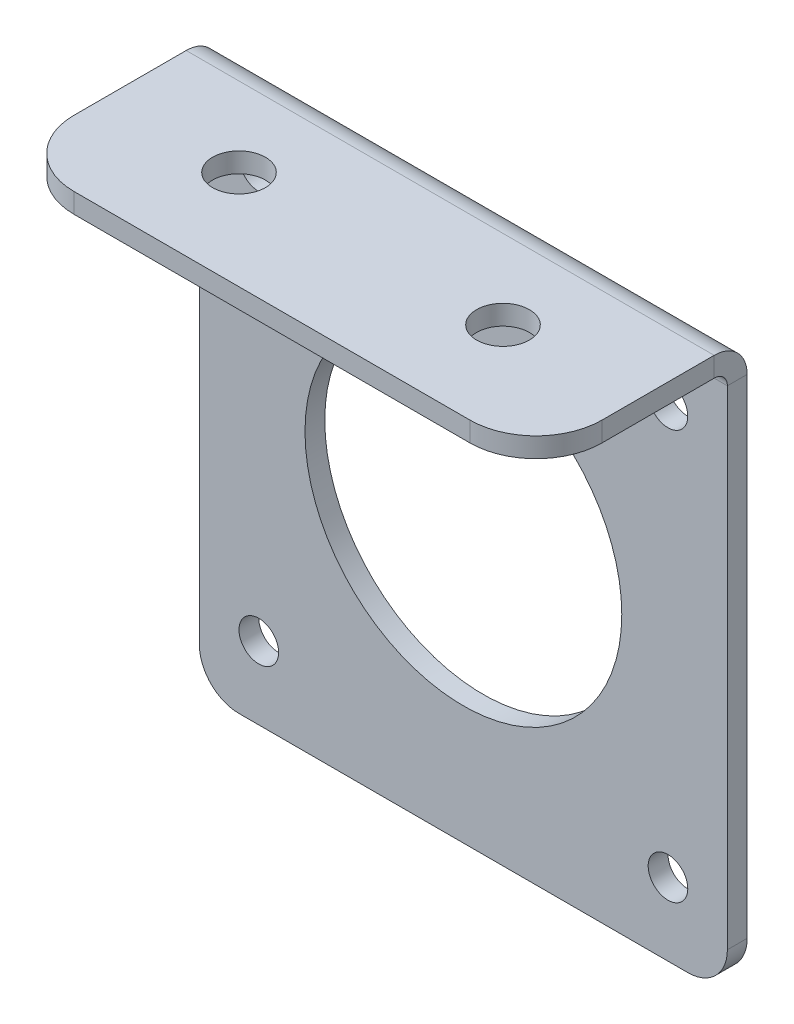
ISO-10303-21;
HEADER;
FILE_DESCRIPTION(('STEP AP214'),'2;1');
FILE_NAME('part.step','',(''),(''),'','','');
FILE_SCHEMA(('AUTOMOTIVE_DESIGN { 1 0 10303 214 1 1 1 1 }'));
ENDSEC;
DATA;
#1=APPLICATION_CONTEXT('core data for automotive mechanical design processes');
#2=APPLICATION_PROTOCOL_DEFINITION('international standard','automotive_design',2000,#1);
#3=PRODUCT_CONTEXT('',#1,'mechanical');
#4=PRODUCT('Part','Part','',(#3));
#5=PRODUCT_RELATED_PRODUCT_CATEGORY('part','',(#4));
#6=PRODUCT_DEFINITION_FORMATION('','',#4);
#7=PRODUCT_DEFINITION_CONTEXT('part definition',#1,'design');
#8=PRODUCT_DEFINITION('design','',#6,#7);
#9=PRODUCT_DEFINITION_SHAPE('','',#8);
#10=(LENGTH_UNIT() NAMED_UNIT(*) SI_UNIT(.MILLI.,.METRE.));
#11=(NAMED_UNIT(*) PLANE_ANGLE_UNIT() SI_UNIT($,.RADIAN.));
#12=(NAMED_UNIT(*) SI_UNIT($,.STERADIAN.) SOLID_ANGLE_UNIT());
#13=UNCERTAINTY_MEASURE_WITH_UNIT(LENGTH_MEASURE(1.E-05),#10,'distance_accuracy_value','');
#14=(GEOMETRIC_REPRESENTATION_CONTEXT(3) GLOBAL_UNCERTAINTY_ASSIGNED_CONTEXT((#13)) GLOBAL_UNIT_ASSIGNED_CONTEXT((#10,
#11,#12)) REPRESENTATION_CONTEXT('',''));
#15=CARTESIAN_POINT('',(0.,0.,0.));
#16=DIRECTION('',(0.,0.,1.));
#17=DIRECTION('',(1.,0.,0.));
#18=AXIS2_PLACEMENT_3D('',#15,#16,#17);
#19=CARTESIAN_POINT('',(-20.,21.5,-1.5));
#20=DIRECTION('',(-1.,0.,0.));
#21=DIRECTION('',(0.,-1.,0.));
#22=AXIS2_PLACEMENT_3D('',#19,#20,#21);
#23=PLANE('',#22);
#24=DIRECTION('',(0.,-1.,0.));
#25=VECTOR('',#24,1.);
#26=CARTESIAN_POINT('',(-20.,21.5,0.));
#27=LINE('',#26,#25);
#28=CARTESIAN_POINT('',(-20.,19.,0.));
#29=VERTEX_POINT('',#28);
#30=CARTESIAN_POINT('',(-20.,-18.,0.));
#31=VERTEX_POINT('',#30);
#32=EDGE_CURVE('E277',#29,#31,#27,.T.);
#33=ORIENTED_EDGE('',*,*,#32,.F.);
#34=DIRECTION('',(0.,0.,-1.));
#35=VECTOR('',#34,1.);
#36=CARTESIAN_POINT('',(-20.,19.,0.));
#37=LINE('',#36,#35);
#38=CARTESIAN_POINT('',(-20.,19.,-1.5));
#39=VERTEX_POINT('',#38);
#40=EDGE_CURVE('E234',#29,#39,#37,.T.);
#41=ORIENTED_EDGE('',*,*,#40,.T.);
#42=DIRECTION('',(0.,-1.,0.));
#43=VECTOR('',#42,1.);
#44=CARTESIAN_POINT('',(-20.,21.5,-1.5));
#45=LINE('',#44,#43);
#46=CARTESIAN_POINT('',(-20.,-18.,-1.5));
#47=VERTEX_POINT('',#46);
#48=EDGE_CURVE('E119',#39,#47,#45,.T.);
#49=ORIENTED_EDGE('',*,*,#48,.T.);
#50=DIRECTION('',(0.,0.,1.));
#51=VECTOR('',#50,1.);
#52=CARTESIAN_POINT('',(-20.,-18.,-1.5));
#53=LINE('',#52,#51);
#54=EDGE_CURVE('E73',#47,#31,#53,.T.);
#55=ORIENTED_EDGE('',*,*,#54,.T.);
#56=EDGE_LOOP('',(#33,#41,#49,#55));
#57=FACE_BOUND('',#56,.T.);
#58=ADVANCED_FACE('F70',(#57),#23,.T.);
#59=CARTESIAN_POINT('',(-17.,-18.,-1.5));
#60=DIRECTION('',(0.,0.,1.));
#61=DIRECTION('',(1.,0.,0.));
#62=AXIS2_PLACEMENT_3D('',#59,#60,#61);
#63=PLANE('',#62);
#64=CARTESIAN_POINT('',(-15.5,15.5,-1.5));
#65=DIRECTION('',(0.,0.,1.));
#66=DIRECTION('',(1.,0.,0.));
#67=AXIS2_PLACEMENT_3D('',#64,#65,#66);
#68=CIRCLE('',#67,1.5);
#69=CARTESIAN_POINT('',(-14.,15.5,-1.5));
#70=VERTEX_POINT('',#69);
#71=EDGE_CURVE('E274',#70,#70,#68,.T.);
#72=ORIENTED_EDGE('',*,*,#71,.T.);
#73=EDGE_LOOP('',(#72));
#74=FACE_BOUND('',#73,.T.);
#75=CARTESIAN_POINT('',(15.5,15.5,-1.5));
#76=DIRECTION('',(0.,0.,1.));
#77=DIRECTION('',(-1.,0.,0.));
#78=AXIS2_PLACEMENT_3D('',#75,#76,#77);
#79=CIRCLE('',#78,1.5);
#80=CARTESIAN_POINT('',(14.,15.5,-1.5));
#81=VERTEX_POINT('',#80);
#82=EDGE_CURVE('E268',#81,#81,#79,.T.);
#83=ORIENTED_EDGE('',*,*,#82,.T.);
#84=EDGE_LOOP('',(#83));
#85=FACE_BOUND('',#84,.T.);
#86=CARTESIAN_POINT('',(15.5,-15.5,-1.5));
#87=DIRECTION('',(0.,0.,1.));
#88=DIRECTION('',(1.,0.,0.));
#89=AXIS2_PLACEMENT_3D('',#86,#87,#88);
#90=CIRCLE('',#89,1.5);
#91=CARTESIAN_POINT('',(17.,-15.5,-1.5));
#92=VERTEX_POINT('',#91);
#93=EDGE_CURVE('E262',#92,#92,#90,.T.);
#94=ORIENTED_EDGE('',*,*,#93,.T.);
#95=EDGE_LOOP('',(#94));
#96=FACE_BOUND('',#95,.T.);
#97=CARTESIAN_POINT('',(-15.5,-15.5,-1.5));
#98=DIRECTION('',(0.,0.,1.));
#99=DIRECTION('',(-1.,0.,0.));
#100=AXIS2_PLACEMENT_3D('',#97,#98,#99);
#101=CIRCLE('',#100,1.5);
#102=CARTESIAN_POINT('',(-17.,-15.5,-1.5));
#103=VERTEX_POINT('',#102);
#104=EDGE_CURVE('E256',#103,#103,#101,.T.);
#105=ORIENTED_EDGE('',*,*,#104,.T.);
#106=EDGE_LOOP('',(#105));
#107=FACE_BOUND('',#106,.T.);
#108=CARTESIAN_POINT('',(0.,0.,-1.5));
#109=DIRECTION('',(0.,0.,1.));
#110=DIRECTION('',(1.,0.,0.));
#111=AXIS2_PLACEMENT_3D('',#108,#109,#110);
#112=CIRCLE('',#111,12.);
#113=CARTESIAN_POINT('',(12.,0.,-1.5));
#114=VERTEX_POINT('',#113);
#115=EDGE_CURVE('E250',#114,#114,#112,.T.);
#116=ORIENTED_EDGE('',*,*,#115,.T.);
#117=EDGE_LOOP('',(#116));
#118=FACE_BOUND('',#117,.T.);
#119=DIRECTION('',(-1.,0.,0.));
#120=VECTOR('',#119,1.);
#121=CARTESIAN_POINT('',(-20.,19.,-1.5));
#122=LINE('',#121,#120);
#123=CARTESIAN_POINT('',(20.,19.,-1.5));
#124=VERTEX_POINT('',#123);
#125=EDGE_CURVE('E228',#39,#124,#122,.F.);
#126=ORIENTED_EDGE('',*,*,#125,.T.);
#127=DIRECTION('',(0.,1.,0.));
#128=VECTOR('',#127,1.);
#129=CARTESIAN_POINT('',(20.,21.5,-1.5));
#130=LINE('',#129,#128);
#131=CARTESIAN_POINT('',(20.,-18.,-1.5));
#132=VERTEX_POINT('',#131);
#133=EDGE_CURVE('E290',#132,#124,#130,.T.);
#134=ORIENTED_EDGE('',*,*,#133,.F.);
#135=CARTESIAN_POINT('',(17.,-18.,-1.5));
#136=DIRECTION('',(0.,0.,1.));
#137=DIRECTION('',(1.,0.,0.));
#138=AXIS2_PLACEMENT_3D('',#135,#136,#137);
#139=CIRCLE('',#138,3.);
#140=CARTESIAN_POINT('',(17.,-21.,-1.5));
#141=VERTEX_POINT('',#140);
#142=EDGE_CURVE('E288',#141,#132,#139,.T.);
#143=ORIENTED_EDGE('',*,*,#142,.F.);
#144=DIRECTION('',(1.,0.,0.));
#145=VECTOR('',#144,1.);
#146=CARTESIAN_POINT('',(-17.,-21.,-1.5));
#147=LINE('',#146,#145);
#148=CARTESIAN_POINT('',(-17.,-21.,-1.5));
#149=VERTEX_POINT('',#148);
#150=EDGE_CURVE('E285',#149,#141,#147,.T.);
#151=ORIENTED_EDGE('',*,*,#150,.F.);
#152=CARTESIAN_POINT('',(-17.,-18.,-1.5));
#153=DIRECTION('',(0.,0.,1.));
#154=DIRECTION('',(1.,0.,0.));
#155=AXIS2_PLACEMENT_3D('',#152,#153,#154);
#156=CIRCLE('',#155,3.);
#157=EDGE_CURVE('E281',#47,#149,#156,.T.);
#158=ORIENTED_EDGE('',*,*,#157,.F.);
#159=ORIENTED_EDGE('',*,*,#48,.F.);
#160=EDGE_LOOP('',(#126,#134,#143,#151,#158,#159));
#161=FACE_BOUND('',#160,.T.);
#162=ADVANCED_FACE('F326',(#74,#85,#96,#107,#118,#161),#63,.F.);
#163=CARTESIAN_POINT('',(-17.,-18.,0.));
#164=DIRECTION('',(0.,0.,1.));
#165=DIRECTION('',(1.,0.,0.));
#166=AXIS2_PLACEMENT_3D('',#163,#164,#165);
#167=PLANE('',#166);
#168=CARTESIAN_POINT('',(0.,0.,0.));
#169=DIRECTION('',(0.,0.,1.));
#170=DIRECTION('',(1.,0.,0.));
#171=AXIS2_PLACEMENT_3D('',#168,#169,#170);
#172=CIRCLE('',#171,12.);
#173=CARTESIAN_POINT('',(12.,0.,0.));
#174=VERTEX_POINT('',#173);
#175=EDGE_CURVE('E248',#174,#174,#172,.T.);
#176=ORIENTED_EDGE('',*,*,#175,.F.);
#177=EDGE_LOOP('',(#176));
#178=FACE_BOUND('',#177,.T.);
#179=CARTESIAN_POINT('',(-15.5,-15.5,0.));
#180=DIRECTION('',(0.,0.,1.));
#181=DIRECTION('',(-1.,0.,0.));
#182=AXIS2_PLACEMENT_3D('',#179,#180,#181);
#183=CIRCLE('',#182,1.5);
#184=CARTESIAN_POINT('',(-17.,-15.5,0.));
#185=VERTEX_POINT('',#184);
#186=EDGE_CURVE('E253',#185,#185,#183,.T.);
#187=ORIENTED_EDGE('',*,*,#186,.F.);
#188=EDGE_LOOP('',(#187));
#189=FACE_BOUND('',#188,.T.);
#190=CARTESIAN_POINT('',(15.5,-15.5,0.));
#191=DIRECTION('',(0.,0.,1.));
#192=DIRECTION('',(1.,0.,0.));
#193=AXIS2_PLACEMENT_3D('',#190,#191,#192);
#194=CIRCLE('',#193,1.5);
#195=CARTESIAN_POINT('',(17.,-15.5,0.));
#196=VERTEX_POINT('',#195);
#197=EDGE_CURVE('E259',#196,#196,#194,.T.);
#198=ORIENTED_EDGE('',*,*,#197,.F.);
#199=EDGE_LOOP('',(#198));
#200=FACE_BOUND('',#199,.T.);
#201=CARTESIAN_POINT('',(15.5,15.5,0.));
#202=DIRECTION('',(0.,0.,1.));
#203=DIRECTION('',(-1.,0.,0.));
#204=AXIS2_PLACEMENT_3D('',#201,#202,#203);
#205=CIRCLE('',#204,1.5);
#206=CARTESIAN_POINT('',(14.,15.5,0.));
#207=VERTEX_POINT('',#206);
#208=EDGE_CURVE('E265',#207,#207,#205,.T.);
#209=ORIENTED_EDGE('',*,*,#208,.F.);
#210=EDGE_LOOP('',(#209));
#211=FACE_BOUND('',#210,.T.);
#212=CARTESIAN_POINT('',(-15.5,15.5,0.));
#213=DIRECTION('',(0.,0.,1.));
#214=DIRECTION('',(1.,0.,0.));
#215=AXIS2_PLACEMENT_3D('',#212,#213,#214);
#216=CIRCLE('',#215,1.5);
#217=CARTESIAN_POINT('',(-14.,15.5,0.));
#218=VERTEX_POINT('',#217);
#219=EDGE_CURVE('E271',#218,#218,#216,.T.);
#220=ORIENTED_EDGE('',*,*,#219,.F.);
#221=EDGE_LOOP('',(#220));
#222=FACE_BOUND('',#221,.T.);
#223=DIRECTION('',(0.,1.,0.));
#224=VECTOR('',#223,1.);
#225=CARTESIAN_POINT('',(20.,21.5,0.));
#226=LINE('',#225,#224);
#227=CARTESIAN_POINT('',(20.,-18.,0.));
#228=VERTEX_POINT('',#227);
#229=CARTESIAN_POINT('',(20.,19.,0.));
#230=VERTEX_POINT('',#229);
#231=EDGE_CURVE('E282',#228,#230,#226,.T.);
#232=ORIENTED_EDGE('',*,*,#231,.T.);
#233=DIRECTION('',(-1.,0.,0.));
#234=VECTOR('',#233,1.);
#235=CARTESIAN_POINT('',(-20.,19.,0.));
#236=LINE('',#235,#234);
#237=EDGE_CURVE('E86',#29,#230,#236,.F.);
#238=ORIENTED_EDGE('',*,*,#237,.F.);
#239=ORIENTED_EDGE('',*,*,#32,.T.);
#240=CARTESIAN_POINT('',(-17.,-18.,0.));
#241=DIRECTION('',(0.,0.,1.));
#242=DIRECTION('',(1.,0.,0.));
#243=AXIS2_PLACEMENT_3D('',#240,#241,#242);
#244=CIRCLE('',#243,3.);
#245=CARTESIAN_POINT('',(-17.,-21.,0.));
#246=VERTEX_POINT('',#245);
#247=EDGE_CURVE('E293',#31,#246,#244,.T.);
#248=ORIENTED_EDGE('',*,*,#247,.T.);
#249=DIRECTION('',(1.,0.,0.));
#250=VECTOR('',#249,1.);
#251=CARTESIAN_POINT('',(-17.,-21.,0.));
#252=LINE('',#251,#250);
#253=CARTESIAN_POINT('',(17.,-21.,0.));
#254=VERTEX_POINT('',#253);
#255=EDGE_CURVE('E296',#246,#254,#252,.T.);
#256=ORIENTED_EDGE('',*,*,#255,.T.);
#257=CARTESIAN_POINT('',(17.,-18.,0.));
#258=DIRECTION('',(0.,0.,1.));
#259=DIRECTION('',(1.,0.,0.));
#260=AXIS2_PLACEMENT_3D('',#257,#258,#259);
#261=CIRCLE('',#260,3.);
#262=EDGE_CURVE('E299',#254,#228,#261,.T.);
#263=ORIENTED_EDGE('',*,*,#262,.T.);
#264=EDGE_LOOP('',(#232,#238,#239,#248,#256,#263));
#265=FACE_BOUND('',#264,.T.);
#266=ADVANCED_FACE('F310',(#178,#189,#200,#211,#222,#265),#167,.T.);
#267=CARTESIAN_POINT('',(20.,21.5,-1.5));
#268=DIRECTION('',(1.,0.,0.));
#269=DIRECTION('',(0.,1.,0.));
#270=AXIS2_PLACEMENT_3D('',#267,#268,#269);
#271=PLANE('',#270);
#272=DIRECTION('',(0.,0.,-1.));
#273=VECTOR('',#272,1.);
#274=CARTESIAN_POINT('',(20.,19.,0.));
#275=LINE('',#274,#273);
#276=EDGE_CURVE('E245',#230,#124,#275,.T.);
#277=ORIENTED_EDGE('',*,*,#276,.F.);
#278=ORIENTED_EDGE('',*,*,#231,.F.);
#279=DIRECTION('',(0.,0.,1.));
#280=VECTOR('',#279,1.);
#281=CARTESIAN_POINT('',(20.,-18.,-1.5));
#282=LINE('',#281,#280);
#283=EDGE_CURVE('E13',#132,#228,#282,.T.);
#284=ORIENTED_EDGE('',*,*,#283,.F.);
#285=ORIENTED_EDGE('',*,*,#133,.T.);
#286=EDGE_LOOP('',(#277,#278,#284,#285));
#287=FACE_BOUND('',#286,.T.);
#288=ADVANCED_FACE('F317',(#287),#271,.T.);
#289=CARTESIAN_POINT('',(17.,-18.,-1.5));
#290=DIRECTION('',(0.,0.,1.));
#291=DIRECTION('',(1.,0.,0.));
#292=AXIS2_PLACEMENT_3D('',#289,#290,#291);
#293=CYLINDRICAL_SURFACE('',#292,3.);
#294=ORIENTED_EDGE('',*,*,#262,.F.);
#295=DIRECTION('',(0.,0.,1.));
#296=VECTOR('',#295,1.);
#297=CARTESIAN_POINT('',(17.,-21.,-1.5));
#298=LINE('',#297,#296);
#299=EDGE_CURVE('E78',#141,#254,#298,.T.);
#300=ORIENTED_EDGE('',*,*,#299,.F.);
#301=ORIENTED_EDGE('',*,*,#142,.T.);
#302=ORIENTED_EDGE('',*,*,#283,.T.);
#303=EDGE_LOOP('',(#294,#300,#301,#302));
#304=FACE_BOUND('',#303,.T.);
#305=ADVANCED_FACE('F315',(#304),#293,.T.);
#306=CARTESIAN_POINT('',(-17.,-21.,-1.5));
#307=DIRECTION('',(0.,-1.,0.));
#308=DIRECTION('',(0.,0.,-1.));
#309=AXIS2_PLACEMENT_3D('',#306,#307,#308);
#310=PLANE('',#309);
#311=ORIENTED_EDGE('',*,*,#255,.F.);
#312=DIRECTION('',(0.,0.,1.));
#313=VECTOR('',#312,1.);
#314=CARTESIAN_POINT('',(-17.,-21.,-1.5));
#315=LINE('',#314,#313);
#316=EDGE_CURVE('E303',#149,#246,#315,.T.);
#317=ORIENTED_EDGE('',*,*,#316,.F.);
#318=ORIENTED_EDGE('',*,*,#150,.T.);
#319=ORIENTED_EDGE('',*,*,#299,.T.);
#320=EDGE_LOOP('',(#311,#317,#318,#319));
#321=FACE_BOUND('',#320,.T.);
#322=ADVANCED_FACE('F312',(#321),#310,.T.);
#323=CARTESIAN_POINT('',(-17.,-18.,-1.5));
#324=DIRECTION('',(0.,0.,1.));
#325=DIRECTION('',(1.,0.,0.));
#326=AXIS2_PLACEMENT_3D('',#323,#324,#325);
#327=CYLINDRICAL_SURFACE('',#326,3.);
#328=ORIENTED_EDGE('',*,*,#247,.F.);
#329=ORIENTED_EDGE('',*,*,#54,.F.);
#330=ORIENTED_EDGE('',*,*,#157,.T.);
#331=ORIENTED_EDGE('',*,*,#316,.T.);
#332=EDGE_LOOP('',(#328,#329,#330,#331));
#333=FACE_BOUND('',#332,.T.);
#334=ADVANCED_FACE('F309',(#333),#327,.T.);
#335=CARTESIAN_POINT('',(-15.5,15.5,-1.5));
#336=DIRECTION('',(0.,0.,1.));
#337=DIRECTION('',(1.,0.,0.));
#338=AXIS2_PLACEMENT_3D('',#335,#336,#337);
#339=CYLINDRICAL_SURFACE('',#338,1.5);
#340=ORIENTED_EDGE('',*,*,#71,.F.);
#341=EDGE_LOOP('',(#340));
#342=FACE_BOUND('',#341,.T.);
#343=ORIENTED_EDGE('',*,*,#219,.T.);
#344=EDGE_LOOP('',(#343));
#345=FACE_BOUND('',#344,.T.);
#346=ADVANCED_FACE('F339',(#342,#345),#339,.F.);
#347=CARTESIAN_POINT('',(15.5,15.5,-1.5));
#348=DIRECTION('',(0.,0.,1.));
#349=DIRECTION('',(1.,0.,0.));
#350=AXIS2_PLACEMENT_3D('',#347,#348,#349);
#351=CYLINDRICAL_SURFACE('',#350,1.5);
#352=ORIENTED_EDGE('',*,*,#82,.F.);
#353=EDGE_LOOP('',(#352));
#354=FACE_BOUND('',#353,.T.);
#355=ORIENTED_EDGE('',*,*,#208,.T.);
#356=EDGE_LOOP('',(#355));
#357=FACE_BOUND('',#356,.T.);
#358=ADVANCED_FACE('F342',(#354,#357),#351,.F.);
#359=CARTESIAN_POINT('',(15.5,-15.5,-1.5));
#360=DIRECTION('',(0.,0.,1.));
#361=DIRECTION('',(1.,0.,0.));
#362=AXIS2_PLACEMENT_3D('',#359,#360,#361);
#363=CYLINDRICAL_SURFACE('',#362,1.5);
#364=ORIENTED_EDGE('',*,*,#93,.F.);
#365=EDGE_LOOP('',(#364));
#366=FACE_BOUND('',#365,.T.);
#367=ORIENTED_EDGE('',*,*,#197,.T.);
#368=EDGE_LOOP('',(#367));
#369=FACE_BOUND('',#368,.T.);
#370=ADVANCED_FACE('F346',(#366,#369),#363,.F.);
#371=CARTESIAN_POINT('',(-15.5,-15.5,-1.5));
#372=DIRECTION('',(0.,0.,1.));
#373=DIRECTION('',(1.,0.,0.));
#374=AXIS2_PLACEMENT_3D('',#371,#372,#373);
#375=CYLINDRICAL_SURFACE('',#374,1.5);
#376=ORIENTED_EDGE('',*,*,#104,.F.);
#377=EDGE_LOOP('',(#376));
#378=FACE_BOUND('',#377,.T.);
#379=ORIENTED_EDGE('',*,*,#186,.T.);
#380=EDGE_LOOP('',(#379));
#381=FACE_BOUND('',#380,.T.);
#382=ADVANCED_FACE('F350',(#378,#381),#375,.F.);
#383=CARTESIAN_POINT('',(0.,0.,-1.5));
#384=DIRECTION('',(0.,0.,1.));
#385=DIRECTION('',(1.,0.,0.));
#386=AXIS2_PLACEMENT_3D('',#383,#384,#385);
#387=CYLINDRICAL_SURFACE('',#386,12.);
#388=ORIENTED_EDGE('',*,*,#115,.F.);
#389=EDGE_LOOP('',(#388));
#390=FACE_BOUND('',#389,.T.);
#391=ORIENTED_EDGE('',*,*,#175,.T.);
#392=EDGE_LOOP('',(#391));
#393=FACE_BOUND('',#392,.T.);
#394=ADVANCED_FACE('F354',(#390,#393),#387,.F.);
#395=CARTESIAN_POINT('',(20.,19.,1.));
#396=DIRECTION('',(1.,0.,0.));
#397=DIRECTION('',(0.,0.,-1.));
#398=AXIS2_PLACEMENT_3D('',#395,#396,#397);
#399=PLANE('',#398);
#400=DIRECTION('',(0.,-1.,0.));
#401=VECTOR('',#400,1.);
#402=CARTESIAN_POINT('',(20.,21.5,0.999999999999992));
#403=LINE('',#402,#401);
#404=CARTESIAN_POINT('',(20.,20.,0.999999999999997));
#405=VERTEX_POINT('',#404);
#406=CARTESIAN_POINT('',(20.,21.5,0.999999999999992));
#407=VERTEX_POINT('',#406);
#408=EDGE_CURVE('E192',#405,#407,#403,.F.);
#409=ORIENTED_EDGE('',*,*,#408,.F.);
#410=CARTESIAN_POINT('',(20.,19.,1.));
#411=DIRECTION('',(-1.,0.,0.));
#412=DIRECTION('',(0.,0.,1.));
#413=AXIS2_PLACEMENT_3D('',#410,#411,#412);
#414=CIRCLE('',#413,1.);
#415=EDGE_CURVE('E237',#230,#405,#414,.F.);
#416=ORIENTED_EDGE('',*,*,#415,.F.);
#417=ORIENTED_EDGE('',*,*,#276,.T.);
#418=CARTESIAN_POINT('',(20.,19.,1.));
#419=DIRECTION('',(-1.,0.,0.));
#420=DIRECTION('',(0.,0.,1.));
#421=AXIS2_PLACEMENT_3D('',#418,#419,#420);
#422=CIRCLE('',#421,2.5);
#423=EDGE_CURVE('E230',#124,#407,#422,.F.);
#424=ORIENTED_EDGE('',*,*,#423,.T.);
#425=EDGE_LOOP('',(#409,#416,#417,#424));
#426=FACE_BOUND('',#425,.T.);
#427=ADVANCED_FACE('F358',(#426),#399,.T.);
#428=CARTESIAN_POINT('',(-20.,19.,1.));
#429=DIRECTION('',(1.,0.,0.));
#430=DIRECTION('',(0.,0.,-1.));
#431=AXIS2_PLACEMENT_3D('',#428,#429,#430);
#432=PLANE('',#431);
#433=CARTESIAN_POINT('',(-20.,19.,1.));
#434=DIRECTION('',(-1.,0.,0.));
#435=DIRECTION('',(0.,0.,1.));
#436=AXIS2_PLACEMENT_3D('',#433,#434,#435);
#437=CIRCLE('',#436,1.);
#438=CARTESIAN_POINT('',(-20.,20.,1.));
#439=VERTEX_POINT('',#438);
#440=EDGE_CURVE('E241',#439,#29,#437,.T.);
#441=ORIENTED_EDGE('',*,*,#440,.F.);
#442=DIRECTION('',(0.,-1.,0.));
#443=VECTOR('',#442,1.);
#444=CARTESIAN_POINT('',(-20.,20.,1.));
#445=LINE('',#444,#443);
#446=CARTESIAN_POINT('',(-20.,21.5,0.999999999999996));
#447=VERTEX_POINT('',#446);
#448=EDGE_CURVE('E222',#439,#447,#445,.F.);
#449=ORIENTED_EDGE('',*,*,#448,.T.);
#450=CARTESIAN_POINT('',(-20.,19.,1.));
#451=DIRECTION('',(-1.,0.,0.));
#452=DIRECTION('',(0.,0.,1.));
#453=AXIS2_PLACEMENT_3D('',#450,#451,#452);
#454=CIRCLE('',#453,2.5);
#455=EDGE_CURVE('E231',#447,#39,#454,.T.);
#456=ORIENTED_EDGE('',*,*,#455,.T.);
#457=ORIENTED_EDGE('',*,*,#40,.F.);
#458=EDGE_LOOP('',(#441,#449,#456,#457));
#459=FACE_BOUND('',#458,.T.);
#460=ADVANCED_FACE('F360',(#459),#432,.F.);
#461=CARTESIAN_POINT('',(-20.,19.,1.));
#462=DIRECTION('',(-1.,0.,0.));
#463=DIRECTION('',(0.,1.,0.));
#464=AXIS2_PLACEMENT_3D('',#461,#462,#463);
#465=CYLINDRICAL_SURFACE('',#464,2.5);
#466=ORIENTED_EDGE('',*,*,#125,.F.);
#467=ORIENTED_EDGE('',*,*,#455,.F.);
#468=DIRECTION('',(-1.,0.,0.));
#469=VECTOR('',#468,1.);
#470=CARTESIAN_POINT('',(20.,21.5,0.999999999999992));
#471=LINE('',#470,#469);
#472=EDGE_CURVE('E220',#447,#407,#471,.F.);
#473=ORIENTED_EDGE('',*,*,#472,.T.);
#474=ORIENTED_EDGE('',*,*,#423,.F.);
#475=EDGE_LOOP('',(#466,#467,#473,#474));
#476=FACE_BOUND('',#475,.T.);
#477=ADVANCED_FACE('F363',(#476),#465,.T.);
#478=CARTESIAN_POINT('',(-20.,19.,1.));
#479=DIRECTION('',(-1.,0.,0.));
#480=DIRECTION('',(0.,1.,0.));
#481=AXIS2_PLACEMENT_3D('',#478,#479,#480);
#482=CYLINDRICAL_SURFACE('',#481,1.);
#483=ORIENTED_EDGE('',*,*,#237,.T.);
#484=ORIENTED_EDGE('',*,*,#415,.T.);
#485=DIRECTION('',(-1.,0.,0.));
#486=VECTOR('',#485,1.);
#487=CARTESIAN_POINT('',(20.,20.,0.999999999999997));
#488=LINE('',#487,#486);
#489=EDGE_CURVE('E225',#405,#439,#488,.T.);
#490=ORIENTED_EDGE('',*,*,#489,.T.);
#491=ORIENTED_EDGE('',*,*,#440,.T.);
#492=EDGE_LOOP('',(#483,#484,#490,#491));
#493=FACE_BOUND('',#492,.T.);
#494=ADVANCED_FACE('F368',(#493),#482,.F.);
#495=CARTESIAN_POINT('',(15.,21.5,9.5));
#496=DIRECTION('',(0.,-1.,0.));
#497=DIRECTION('',(0.,0.,-1.));
#498=AXIS2_PLACEMENT_3D('',#495,#496,#497);
#499=PLANE('',#498);
#500=CARTESIAN_POINT('',(-10.,21.5,7.));
#501=DIRECTION('',(0.,-1.,0.));
#502=DIRECTION('',(0.,0.,-1.));
#503=AXIS2_PLACEMENT_3D('',#500,#501,#502);
#504=CIRCLE('',#503,2.);
#505=CARTESIAN_POINT('',(-10.,21.5,5.));
#506=VERTEX_POINT('',#505);
#507=EDGE_CURVE('E214',#506,#506,#504,.F.);
#508=ORIENTED_EDGE('',*,*,#507,.F.);
#509=EDGE_LOOP('',(#508));
#510=FACE_BOUND('',#509,.T.);
#511=CARTESIAN_POINT('',(10.,21.5,7.));
#512=DIRECTION('',(0.,-1.,0.));
#513=DIRECTION('',(0.,0.,-1.));
#514=AXIS2_PLACEMENT_3D('',#511,#512,#513);
#515=CIRCLE('',#514,2.);
#516=CARTESIAN_POINT('',(10.,21.5,5.));
#517=VERTEX_POINT('',#516);
#518=EDGE_CURVE('E208',#517,#517,#515,.F.);
#519=ORIENTED_EDGE('',*,*,#518,.F.);
#520=EDGE_LOOP('',(#519));
#521=FACE_BOUND('',#520,.T.);
#522=ORIENTED_EDGE('',*,*,#472,.F.);
#523=DIRECTION('',(0.,0.,1.));
#524=VECTOR('',#523,1.);
#525=CARTESIAN_POINT('',(-20.,21.5,9.5));
#526=LINE('',#525,#524);
#527=CARTESIAN_POINT('',(-20.,21.5,9.49999999999998));
#528=VERTEX_POINT('',#527);
#529=EDGE_CURVE('E193',#447,#528,#526,.T.);
#530=ORIENTED_EDGE('',*,*,#529,.T.);
#531=CARTESIAN_POINT('',(-15.,21.5,9.5));
#532=DIRECTION('',(0.,-1.,0.));
#533=DIRECTION('',(0.,0.,-1.));
#534=AXIS2_PLACEMENT_3D('',#531,#532,#533);
#535=CIRCLE('',#534,5.);
#536=CARTESIAN_POINT('',(-15.,21.5,14.5));
#537=VERTEX_POINT('',#536);
#538=EDGE_CURVE('E195',#528,#537,#535,.F.);
#539=ORIENTED_EDGE('',*,*,#538,.T.);
#540=DIRECTION('',(1.,0.,0.));
#541=VECTOR('',#540,1.);
#542=CARTESIAN_POINT('',(15.,21.5,14.5));
#543=LINE('',#542,#541);
#544=CARTESIAN_POINT('',(15.,21.5,14.5));
#545=VERTEX_POINT('',#544);
#546=EDGE_CURVE('E175',#537,#545,#543,.T.);
#547=ORIENTED_EDGE('',*,*,#546,.T.);
#548=CARTESIAN_POINT('',(15.,21.5,9.5));
#549=DIRECTION('',(0.,-1.,0.));
#550=DIRECTION('',(0.,0.,-1.));
#551=AXIS2_PLACEMENT_3D('',#548,#549,#550);
#552=CIRCLE('',#551,5.);
#553=CARTESIAN_POINT('',(20.,21.5,9.49999999999998));
#554=VERTEX_POINT('',#553);
#555=EDGE_CURVE('E168',#545,#554,#552,.F.);
#556=ORIENTED_EDGE('',*,*,#555,.T.);
#557=DIRECTION('',(0.,0.,-1.));
#558=VECTOR('',#557,1.);
#559=CARTESIAN_POINT('',(20.,21.5,9.5));
#560=LINE('',#559,#558);
#561=EDGE_CURVE('E173',#554,#407,#560,.T.);
#562=ORIENTED_EDGE('',*,*,#561,.T.);
#563=EDGE_LOOP('',(#522,#530,#539,#547,#556,#562));
#564=FACE_BOUND('',#563,.T.);
#565=ADVANCED_FACE('F171',(#510,#521,#564),#499,.F.);
#566=CARTESIAN_POINT('',(15.,20.,9.50000000000001));
#567=DIRECTION('',(0.,-1.,0.));
#568=DIRECTION('',(0.,0.,-1.));
#569=AXIS2_PLACEMENT_3D('',#566,#567,#568);
#570=PLANE('',#569);
#571=CARTESIAN_POINT('',(10.,20.,7.));
#572=DIRECTION('',(0.,-1.,0.));
#573=DIRECTION('',(0.,0.,-1.));
#574=AXIS2_PLACEMENT_3D('',#571,#572,#573);
#575=CIRCLE('',#574,2.);
#576=CARTESIAN_POINT('',(10.,20.,5.));
#577=VERTEX_POINT('',#576);
#578=EDGE_CURVE('E211',#577,#577,#575,.F.);
#579=ORIENTED_EDGE('',*,*,#578,.T.);
#580=EDGE_LOOP('',(#579));
#581=FACE_BOUND('',#580,.T.);
#582=CARTESIAN_POINT('',(-10.,20.,7.));
#583=DIRECTION('',(0.,-1.,0.));
#584=DIRECTION('',(0.,0.,-1.));
#585=AXIS2_PLACEMENT_3D('',#582,#583,#584);
#586=CIRCLE('',#585,2.);
#587=CARTESIAN_POINT('',(-10.,20.,5.));
#588=VERTEX_POINT('',#587);
#589=EDGE_CURVE('E217',#588,#588,#586,.F.);
#590=ORIENTED_EDGE('',*,*,#589,.T.);
#591=EDGE_LOOP('',(#590));
#592=FACE_BOUND('',#591,.T.);
#593=DIRECTION('',(0.,0.,-1.));
#594=VECTOR('',#593,1.);
#595=CARTESIAN_POINT('',(-20.,20.,9.49999999999997));
#596=LINE('',#595,#594);
#597=CARTESIAN_POINT('',(-20.,20.,9.49999999999999));
#598=VERTEX_POINT('',#597);
#599=EDGE_CURVE('E204',#439,#598,#596,.F.);
#600=ORIENTED_EDGE('',*,*,#599,.F.);
#601=ORIENTED_EDGE('',*,*,#489,.F.);
#602=DIRECTION('',(0.,0.,1.));
#603=VECTOR('',#602,1.);
#604=CARTESIAN_POINT('',(20.,20.,0.));
#605=LINE('',#604,#603);
#606=CARTESIAN_POINT('',(20.,20.,9.49999999999999));
#607=VERTEX_POINT('',#606);
#608=EDGE_CURVE('E206',#607,#405,#605,.F.);
#609=ORIENTED_EDGE('',*,*,#608,.F.);
#610=CARTESIAN_POINT('',(15.,20.,9.50000000000001));
#611=DIRECTION('',(0.,-1.,0.));
#612=DIRECTION('',(0.,0.,-1.));
#613=AXIS2_PLACEMENT_3D('',#610,#611,#612);
#614=CIRCLE('',#613,5.);
#615=CARTESIAN_POINT('',(15.,20.,14.5));
#616=VERTEX_POINT('',#615);
#617=EDGE_CURVE('E184',#616,#607,#614,.F.);
#618=ORIENTED_EDGE('',*,*,#617,.F.);
#619=DIRECTION('',(-1.,0.,0.));
#620=VECTOR('',#619,1.);
#621=CARTESIAN_POINT('',(15.,20.,14.5));
#622=LINE('',#621,#620);
#623=CARTESIAN_POINT('',(-15.,20.,14.5));
#624=VERTEX_POINT('',#623);
#625=EDGE_CURVE('E197',#624,#616,#622,.F.);
#626=ORIENTED_EDGE('',*,*,#625,.F.);
#627=CARTESIAN_POINT('',(-15.,20.,9.50000000000001));
#628=DIRECTION('',(0.,-1.,0.));
#629=DIRECTION('',(0.,0.,-1.));
#630=AXIS2_PLACEMENT_3D('',#627,#628,#629);
#631=CIRCLE('',#630,5.);
#632=EDGE_CURVE('E202',#598,#624,#631,.F.);
#633=ORIENTED_EDGE('',*,*,#632,.F.);
#634=EDGE_LOOP('',(#600,#601,#609,#618,#626,#633));
#635=FACE_BOUND('',#634,.T.);
#636=ADVANCED_FACE('F378',(#581,#592,#635),#570,.T.);
#637=CARTESIAN_POINT('',(20.,21.5,0.));
#638=DIRECTION('',(-1.,0.,0.));
#639=DIRECTION('',(0.,0.,1.));
#640=AXIS2_PLACEMENT_3D('',#637,#638,#639);
#641=PLANE('',#640);
#642=ORIENTED_EDGE('',*,*,#408,.T.);
#643=ORIENTED_EDGE('',*,*,#561,.F.);
#644=DIRECTION('',(0.,-1.,0.));
#645=VECTOR('',#644,1.);
#646=CARTESIAN_POINT('',(20.,21.5,9.49999999999996));
#647=LINE('',#646,#645);
#648=EDGE_CURVE('E179',#554,#607,#647,.T.);
#649=ORIENTED_EDGE('',*,*,#648,.T.);
#650=ORIENTED_EDGE('',*,*,#608,.T.);
#651=EDGE_LOOP('',(#642,#643,#649,#650));
#652=FACE_BOUND('',#651,.T.);
#653=ADVANCED_FACE('F191',(#652),#641,.F.);
#654=CARTESIAN_POINT('',(-20.,21.5,9.49999999999996));
#655=DIRECTION('',(1.,0.,0.));
#656=DIRECTION('',(0.,0.,-1.));
#657=AXIS2_PLACEMENT_3D('',#654,#655,#656);
#658=PLANE('',#657);
#659=ORIENTED_EDGE('',*,*,#448,.F.);
#660=ORIENTED_EDGE('',*,*,#599,.T.);
#661=DIRECTION('',(0.,-1.,0.));
#662=VECTOR('',#661,1.);
#663=CARTESIAN_POINT('',(-20.,21.5,9.49999999999996));
#664=LINE('',#663,#662);
#665=EDGE_CURVE('E244',#528,#598,#664,.T.);
#666=ORIENTED_EDGE('',*,*,#665,.F.);
#667=ORIENTED_EDGE('',*,*,#529,.F.);
#668=EDGE_LOOP('',(#659,#660,#666,#667));
#669=FACE_BOUND('',#668,.T.);
#670=ADVANCED_FACE('F377',(#669),#658,.F.);
#671=CARTESIAN_POINT('',(-15.,21.5,9.5));
#672=DIRECTION('',(0.,-1.,0.));
#673=DIRECTION('',(0.,0.,-1.));
#674=AXIS2_PLACEMENT_3D('',#671,#672,#673);
#675=CYLINDRICAL_SURFACE('',#674,5.);
#676=ORIENTED_EDGE('',*,*,#632,.T.);
#677=DIRECTION('',(0.,-1.,0.));
#678=VECTOR('',#677,1.);
#679=CARTESIAN_POINT('',(-15.,21.5,14.5));
#680=LINE('',#679,#678);
#681=EDGE_CURVE('E423',#537,#624,#680,.T.);
#682=ORIENTED_EDGE('',*,*,#681,.F.);
#683=ORIENTED_EDGE('',*,*,#538,.F.);
#684=ORIENTED_EDGE('',*,*,#665,.T.);
#685=EDGE_LOOP('',(#676,#682,#683,#684));
#686=FACE_BOUND('',#685,.T.);
#687=ADVANCED_FACE('F381',(#686),#675,.T.);
#688=CARTESIAN_POINT('',(15.,21.5,14.5));
#689=DIRECTION('',(0.,0.,-1.));
#690=DIRECTION('',(0.,1.,0.));
#691=AXIS2_PLACEMENT_3D('',#688,#689,#690);
#692=PLANE('',#691);
#693=ORIENTED_EDGE('',*,*,#625,.T.);
#694=DIRECTION('',(0.,-1.,0.));
#695=VECTOR('',#694,1.);
#696=CARTESIAN_POINT('',(15.,21.5,14.5));
#697=LINE('',#696,#695);
#698=EDGE_CURVE('E188',#545,#616,#697,.T.);
#699=ORIENTED_EDGE('',*,*,#698,.F.);
#700=ORIENTED_EDGE('',*,*,#546,.F.);
#701=ORIENTED_EDGE('',*,*,#681,.T.);
#702=EDGE_LOOP('',(#693,#699,#700,#701));
#703=FACE_BOUND('',#702,.T.);
#704=ADVANCED_FACE('F385',(#703),#692,.F.);
#705=CARTESIAN_POINT('',(15.,21.5,9.5));
#706=DIRECTION('',(0.,-1.,0.));
#707=DIRECTION('',(0.,0.,-1.));
#708=AXIS2_PLACEMENT_3D('',#705,#706,#707);
#709=CYLINDRICAL_SURFACE('',#708,5.);
#710=ORIENTED_EDGE('',*,*,#617,.T.);
#711=ORIENTED_EDGE('',*,*,#648,.F.);
#712=ORIENTED_EDGE('',*,*,#555,.F.);
#713=ORIENTED_EDGE('',*,*,#698,.T.);
#714=EDGE_LOOP('',(#710,#711,#712,#713));
#715=FACE_BOUND('',#714,.T.);
#716=ADVANCED_FACE('F182',(#715),#709,.T.);
#717=CARTESIAN_POINT('',(10.,21.5,7.));
#718=DIRECTION('',(0.,-1.,0.));
#719=DIRECTION('',(0.,0.,-1.));
#720=AXIS2_PLACEMENT_3D('',#717,#718,#719);
#721=CYLINDRICAL_SURFACE('',#720,2.);
#722=ORIENTED_EDGE('',*,*,#518,.T.);
#723=EDGE_LOOP('',(#722));
#724=FACE_BOUND('',#723,.T.);
#725=ORIENTED_EDGE('',*,*,#578,.F.);
#726=EDGE_LOOP('',(#725));
#727=FACE_BOUND('',#726,.T.);
#728=ADVANCED_FACE('F392',(#724,#727),#721,.F.);
#729=CARTESIAN_POINT('',(-10.,21.5,7.));
#730=DIRECTION('',(0.,-1.,0.));
#731=DIRECTION('',(0.,0.,-1.));
#732=AXIS2_PLACEMENT_3D('',#729,#730,#731);
#733=CYLINDRICAL_SURFACE('',#732,2.);
#734=ORIENTED_EDGE('',*,*,#507,.T.);
#735=EDGE_LOOP('',(#734));
#736=FACE_BOUND('',#735,.T.);
#737=ORIENTED_EDGE('',*,*,#589,.F.);
#738=EDGE_LOOP('',(#737));
#739=FACE_BOUND('',#738,.T.);
#740=ADVANCED_FACE('F401',(#736,#739),#733,.F.);
#741=CLOSED_SHELL('',(#58,#162,#266,#288,#305,#322,#334,#346,#358,#370,#382,#394,#427,#460,#477,
#494,#565,#636,#653,#670,#687,#704,#716,#728,#740));
#742=MANIFOLD_SOLID_BREP('B2',#741);
#743=ADVANCED_BREP_SHAPE_REPRESENTATION('',(#18,#742),#14);
#744=SHAPE_DEFINITION_REPRESENTATION(#9,#743);
ENDSEC;
END-ISO-10303-21;
